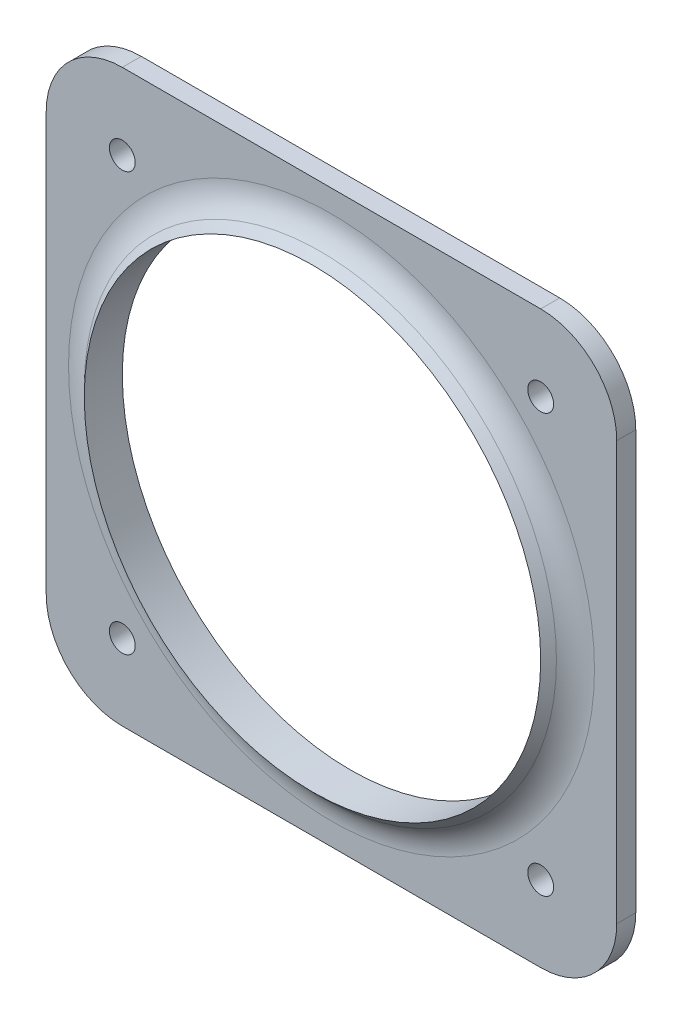
ISO-10303-21;
HEADER;
FILE_DESCRIPTION(('STEP AP214'),'2;1');
FILE_NAME('part.step','',(''),(''),'','','');
FILE_SCHEMA(('AUTOMOTIVE_DESIGN { 1 0 10303 214 1 1 1 1 }'));
ENDSEC;
DATA;
#1=APPLICATION_CONTEXT('core data for automotive mechanical design processes');
#2=APPLICATION_PROTOCOL_DEFINITION('international standard','automotive_design',2000,#1);
#3=PRODUCT_CONTEXT('',#1,'mechanical');
#4=PRODUCT('Part','Part','',(#3));
#5=PRODUCT_RELATED_PRODUCT_CATEGORY('part','',(#4));
#6=PRODUCT_DEFINITION_FORMATION('','',#4);
#7=PRODUCT_DEFINITION_CONTEXT('part definition',#1,'design');
#8=PRODUCT_DEFINITION('design','',#6,#7);
#9=PRODUCT_DEFINITION_SHAPE('','',#8);
#10=(LENGTH_UNIT() NAMED_UNIT(*) SI_UNIT(.MILLI.,.METRE.));
#11=(NAMED_UNIT(*) PLANE_ANGLE_UNIT() SI_UNIT($,.RADIAN.));
#12=(NAMED_UNIT(*) SI_UNIT($,.STERADIAN.) SOLID_ANGLE_UNIT());
#13=UNCERTAINTY_MEASURE_WITH_UNIT(LENGTH_MEASURE(1.E-05),#10,'distance_accuracy_value','');
#14=(GEOMETRIC_REPRESENTATION_CONTEXT(3) GLOBAL_UNCERTAINTY_ASSIGNED_CONTEXT((#13)) GLOBAL_UNIT_ASSIGNED_CONTEXT((#10,
#11,#12)) REPRESENTATION_CONTEXT('',''));
#15=CARTESIAN_POINT('',(0.,0.,0.));
#16=DIRECTION('',(0.,0.,1.));
#17=DIRECTION('',(1.,0.,0.));
#18=AXIS2_PLACEMENT_3D('',#15,#16,#17);
#19=CARTESIAN_POINT('',(0.,0.,3.175));
#20=DIRECTION('',(0.,0.,1.));
#21=DIRECTION('',(1.,0.,0.));
#22=AXIS2_PLACEMENT_3D('',#19,#20,#21);
#23=PLANE('',#22);
#24=CARTESIAN_POINT('',(-34.925,-34.925,3.175));
#25=DIRECTION('',(0.,0.,1.));
#26=DIRECTION('',(1.,0.,0.));
#27=AXIS2_PLACEMENT_3D('',#24,#25,#26);
#28=CIRCLE('',#27,2.159);
#29=CARTESIAN_POINT('',(-32.766,-34.925,3.175));
#30=VERTEX_POINT('',#29);
#31=EDGE_CURVE('E207',#30,#30,#28,.T.);
#32=ORIENTED_EDGE('',*,*,#31,.F.);
#33=EDGE_LOOP('',(#32));
#34=FACE_BOUND('',#33,.T.);
#35=CARTESIAN_POINT('',(34.925,-34.925,3.175));
#36=DIRECTION('',(0.,0.,1.));
#37=DIRECTION('',(1.,0.,0.));
#38=AXIS2_PLACEMENT_3D('',#35,#36,#37);
#39=CIRCLE('',#38,2.159);
#40=CARTESIAN_POINT('',(37.084,-34.925,3.175));
#41=VERTEX_POINT('',#40);
#42=EDGE_CURVE('E201',#41,#41,#39,.T.);
#43=ORIENTED_EDGE('',*,*,#42,.F.);
#44=EDGE_LOOP('',(#43));
#45=FACE_BOUND('',#44,.T.);
#46=CARTESIAN_POINT('',(34.925,34.925,3.175));
#47=DIRECTION('',(0.,0.,1.));
#48=DIRECTION('',(1.,0.,0.));
#49=AXIS2_PLACEMENT_3D('',#46,#47,#48);
#50=CIRCLE('',#49,2.159);
#51=CARTESIAN_POINT('',(37.084,34.925,3.175));
#52=VERTEX_POINT('',#51);
#53=EDGE_CURVE('E195',#52,#52,#50,.T.);
#54=ORIENTED_EDGE('',*,*,#53,.F.);
#55=EDGE_LOOP('',(#54));
#56=FACE_BOUND('',#55,.T.);
#57=CARTESIAN_POINT('',(-34.925,34.925,3.175));
#58=DIRECTION('',(0.,0.,1.));
#59=DIRECTION('',(1.,0.,0.));
#60=AXIS2_PLACEMENT_3D('',#57,#58,#59);
#61=CIRCLE('',#60,2.159);
#62=CARTESIAN_POINT('',(-32.766,34.925,3.175));
#63=VERTEX_POINT('',#62);
#64=EDGE_CURVE('E189',#63,#63,#61,.T.);
#65=ORIENTED_EDGE('',*,*,#64,.F.);
#66=EDGE_LOOP('',(#65));
#67=FACE_BOUND('',#66,.T.);
#68=CARTESIAN_POINT('',(1.95734232339416E-13,0.,3.175));
#69=DIRECTION('',(0.,0.,1.));
#70=DIRECTION('',(1.,0.,0.));
#71=AXIS2_PLACEMENT_3D('',#68,#69,#70);
#72=CIRCLE('',#71,43.9052561210692);
#73=CARTESIAN_POINT('',(43.9052561210694,0.,3.175));
#74=VERTEX_POINT('',#73);
#75=EDGE_CURVE('E145',#74,#74,#72,.F.);
#76=ORIENTED_EDGE('',*,*,#75,.T.);
#77=EDGE_LOOP('',(#76));
#78=FACE_BOUND('',#77,.T.);
#79=DIRECTION('',(-1.,0.,0.));
#80=VECTOR('',#79,1.);
#81=CARTESIAN_POINT('',(47.625,47.625,3.175));
#82=LINE('',#81,#80);
#83=CARTESIAN_POINT('',(34.925,47.625,3.175));
#84=VERTEX_POINT('',#83);
#85=CARTESIAN_POINT('',(-34.925,47.625,3.175));
#86=VERTEX_POINT('',#85);
#87=EDGE_CURVE('E136',#84,#86,#82,.T.);
#88=ORIENTED_EDGE('',*,*,#87,.T.);
#89=CARTESIAN_POINT('',(-34.925,34.925,3.175));
#90=DIRECTION('',(0.,0.,1.));
#91=DIRECTION('',(1.,0.,0.));
#92=AXIS2_PLACEMENT_3D('',#89,#90,#91);
#93=CIRCLE('',#92,12.7);
#94=CARTESIAN_POINT('',(-47.625,34.925,3.175));
#95=VERTEX_POINT('',#94);
#96=EDGE_CURVE('E161',#86,#95,#93,.T.);
#97=ORIENTED_EDGE('',*,*,#96,.T.);
#98=DIRECTION('',(0.,-1.,0.));
#99=VECTOR('',#98,1.);
#100=CARTESIAN_POINT('',(-47.625,-47.625,3.175));
#101=LINE('',#100,#99);
#102=CARTESIAN_POINT('',(-47.625,-34.925,3.175));
#103=VERTEX_POINT('',#102);
#104=EDGE_CURVE('E119',#95,#103,#101,.T.);
#105=ORIENTED_EDGE('',*,*,#104,.T.);
#106=CARTESIAN_POINT('',(-34.925,-34.925,3.175));
#107=DIRECTION('',(0.,0.,1.));
#108=DIRECTION('',(1.,0.,0.));
#109=AXIS2_PLACEMENT_3D('',#106,#107,#108);
#110=CIRCLE('',#109,12.7);
#111=CARTESIAN_POINT('',(-34.925,-47.625,3.175));
#112=VERTEX_POINT('',#111);
#113=EDGE_CURVE('E156',#103,#112,#110,.T.);
#114=ORIENTED_EDGE('',*,*,#113,.T.);
#115=DIRECTION('',(1.,0.,0.));
#116=VECTOR('',#115,1.);
#117=CARTESIAN_POINT('',(47.625,-47.625,3.175));
#118=LINE('',#117,#116);
#119=CARTESIAN_POINT('',(34.925,-47.625,3.175));
#120=VERTEX_POINT('',#119);
#121=EDGE_CURVE('E172',#112,#120,#118,.T.);
#122=ORIENTED_EDGE('',*,*,#121,.T.);
#123=CARTESIAN_POINT('',(34.925,-34.925,3.175));
#124=DIRECTION('',(0.,0.,1.));
#125=DIRECTION('',(1.,0.,0.));
#126=AXIS2_PLACEMENT_3D('',#123,#124,#125);
#127=CIRCLE('',#126,12.7);
#128=CARTESIAN_POINT('',(47.625,-34.925,3.175));
#129=VERTEX_POINT('',#128);
#130=EDGE_CURVE('E55',#120,#129,#127,.T.);
#131=ORIENTED_EDGE('',*,*,#130,.T.);
#132=DIRECTION('',(0.,1.,0.));
#133=VECTOR('',#132,1.);
#134=CARTESIAN_POINT('',(47.625,-47.625,3.175));
#135=LINE('',#134,#133);
#136=CARTESIAN_POINT('',(47.625,34.925,3.175));
#137=VERTEX_POINT('',#136);
#138=EDGE_CURVE('E180',#129,#137,#135,.T.);
#139=ORIENTED_EDGE('',*,*,#138,.T.);
#140=CARTESIAN_POINT('',(34.925,34.925,3.175));
#141=DIRECTION('',(0.,0.,1.));
#142=DIRECTION('',(1.,0.,0.));
#143=AXIS2_PLACEMENT_3D('',#140,#141,#142);
#144=CIRCLE('',#143,12.7);
#145=EDGE_CURVE('E159',#137,#84,#144,.T.);
#146=ORIENTED_EDGE('',*,*,#145,.T.);
#147=EDGE_LOOP('',(#88,#97,#105,#114,#122,#131,#139,#146));
#148=FACE_BOUND('',#147,.T.);
#149=ADVANCED_FACE('F33',(#34,#45,#56,#67,#78,#148),#23,.T.);
#150=CARTESIAN_POINT('',(0.,0.,0.));
#151=DIRECTION('',(0.,0.,1.));
#152=DIRECTION('',(1.,0.,0.));
#153=AXIS2_PLACEMENT_3D('',#150,#151,#152);
#154=PLANE('',#153);
#155=CARTESIAN_POINT('',(-34.925,-34.925,0.));
#156=DIRECTION('',(0.,0.,1.));
#157=DIRECTION('',(1.,0.,0.));
#158=AXIS2_PLACEMENT_3D('',#155,#156,#157);
#159=CIRCLE('',#158,2.159);
#160=CARTESIAN_POINT('',(-32.766,-34.925,0.));
#161=VERTEX_POINT('',#160);
#162=EDGE_CURVE('E204',#161,#161,#159,.T.);
#163=ORIENTED_EDGE('',*,*,#162,.T.);
#164=EDGE_LOOP('',(#163));
#165=FACE_BOUND('',#164,.T.);
#166=CARTESIAN_POINT('',(34.925,-34.925,0.));
#167=DIRECTION('',(0.,0.,1.));
#168=DIRECTION('',(1.,0.,0.));
#169=AXIS2_PLACEMENT_3D('',#166,#167,#168);
#170=CIRCLE('',#169,2.159);
#171=CARTESIAN_POINT('',(37.084,-34.925,0.));
#172=VERTEX_POINT('',#171);
#173=EDGE_CURVE('E198',#172,#172,#170,.T.);
#174=ORIENTED_EDGE('',*,*,#173,.T.);
#175=EDGE_LOOP('',(#174));
#176=FACE_BOUND('',#175,.T.);
#177=CARTESIAN_POINT('',(34.925,34.925,0.));
#178=DIRECTION('',(0.,0.,1.));
#179=DIRECTION('',(1.,0.,0.));
#180=AXIS2_PLACEMENT_3D('',#177,#178,#179);
#181=CIRCLE('',#180,2.159);
#182=CARTESIAN_POINT('',(37.084,34.925,0.));
#183=VERTEX_POINT('',#182);
#184=EDGE_CURVE('E192',#183,#183,#181,.T.);
#185=ORIENTED_EDGE('',*,*,#184,.T.);
#186=EDGE_LOOP('',(#185));
#187=FACE_BOUND('',#186,.T.);
#188=CARTESIAN_POINT('',(-34.925,34.925,0.));
#189=DIRECTION('',(0.,0.,1.));
#190=DIRECTION('',(1.,0.,0.));
#191=AXIS2_PLACEMENT_3D('',#188,#189,#190);
#192=CIRCLE('',#191,2.159);
#193=CARTESIAN_POINT('',(-32.766,34.925,0.));
#194=VERTEX_POINT('',#193);
#195=EDGE_CURVE('E188',#194,#194,#192,.T.);
#196=ORIENTED_EDGE('',*,*,#195,.T.);
#197=EDGE_LOOP('',(#196));
#198=FACE_BOUND('',#197,.T.);
#199=DIRECTION('',(0.,-1.,0.));
#200=VECTOR('',#199,1.);
#201=CARTESIAN_POINT('',(-47.625,-47.625,0.));
#202=LINE('',#201,#200);
#203=CARTESIAN_POINT('',(-47.625,34.925,0.));
#204=VERTEX_POINT('',#203);
#205=CARTESIAN_POINT('',(-47.625,-34.925,0.));
#206=VERTEX_POINT('',#205);
#207=EDGE_CURVE('E116',#204,#206,#202,.T.);
#208=ORIENTED_EDGE('',*,*,#207,.F.);
#209=CARTESIAN_POINT('',(-34.925,34.925,0.));
#210=DIRECTION('',(0.,0.,1.));
#211=DIRECTION('',(1.,0.,0.));
#212=AXIS2_PLACEMENT_3D('',#209,#210,#211);
#213=CIRCLE('',#212,12.7);
#214=CARTESIAN_POINT('',(-34.925,47.625,0.));
#215=VERTEX_POINT('',#214);
#216=EDGE_CURVE('E99',#204,#215,#213,.F.);
#217=ORIENTED_EDGE('',*,*,#216,.T.);
#218=DIRECTION('',(-1.,0.,0.));
#219=VECTOR('',#218,1.);
#220=CARTESIAN_POINT('',(47.625,47.625,0.));
#221=LINE('',#220,#219);
#222=CARTESIAN_POINT('',(34.925,47.625,0.));
#223=VERTEX_POINT('',#222);
#224=EDGE_CURVE('E140',#223,#215,#221,.T.);
#225=ORIENTED_EDGE('',*,*,#224,.F.);
#226=CARTESIAN_POINT('',(34.925,34.925,0.));
#227=DIRECTION('',(0.,0.,1.));
#228=DIRECTION('',(1.,0.,0.));
#229=AXIS2_PLACEMENT_3D('',#226,#227,#228);
#230=CIRCLE('',#229,12.7);
#231=CARTESIAN_POINT('',(47.625,34.925,0.));
#232=VERTEX_POINT('',#231);
#233=EDGE_CURVE('E110',#223,#232,#230,.F.);
#234=ORIENTED_EDGE('',*,*,#233,.T.);
#235=DIRECTION('',(0.,1.,0.));
#236=VECTOR('',#235,1.);
#237=CARTESIAN_POINT('',(47.625,-47.625,0.));
#238=LINE('',#237,#236);
#239=CARTESIAN_POINT('',(47.625,-34.925,0.));
#240=VERTEX_POINT('',#239);
#241=EDGE_CURVE('E130',#240,#232,#238,.T.);
#242=ORIENTED_EDGE('',*,*,#241,.F.);
#243=CARTESIAN_POINT('',(34.925,-34.925,0.));
#244=DIRECTION('',(0.,0.,1.));
#245=DIRECTION('',(1.,0.,0.));
#246=AXIS2_PLACEMENT_3D('',#243,#244,#245);
#247=CIRCLE('',#246,12.7);
#248=CARTESIAN_POINT('',(34.925,-47.625,0.));
#249=VERTEX_POINT('',#248);
#250=EDGE_CURVE('E150',#240,#249,#247,.F.);
#251=ORIENTED_EDGE('',*,*,#250,.T.);
#252=DIRECTION('',(1.,0.,0.));
#253=VECTOR('',#252,1.);
#254=CARTESIAN_POINT('',(47.625,-47.625,0.));
#255=LINE('',#254,#253);
#256=CARTESIAN_POINT('',(-34.925,-47.625,0.));
#257=VERTEX_POINT('',#256);
#258=EDGE_CURVE('E126',#257,#249,#255,.T.);
#259=ORIENTED_EDGE('',*,*,#258,.F.);
#260=CARTESIAN_POINT('',(-34.925,-34.925,0.));
#261=DIRECTION('',(0.,0.,1.));
#262=DIRECTION('',(1.,0.,0.));
#263=AXIS2_PLACEMENT_3D('',#260,#261,#262);
#264=CIRCLE('',#263,12.7);
#265=EDGE_CURVE('E120',#257,#206,#264,.F.);
#266=ORIENTED_EDGE('',*,*,#265,.T.);
#267=EDGE_LOOP('',(#208,#217,#225,#234,#242,#251,#259,#266));
#268=FACE_BOUND('',#267,.T.);
#269=CARTESIAN_POINT('',(0.,0.,0.));
#270=DIRECTION('',(0.,0.,1.));
#271=DIRECTION('',(1.,0.,0.));
#272=AXIS2_PLACEMENT_3D('',#269,#270,#271);
#273=CIRCLE('',#272,38.1);
#274=CARTESIAN_POINT('',(38.1,0.,0.));
#275=VERTEX_POINT('',#274);
#276=EDGE_CURVE('E127',#275,#275,#273,.T.);
#277=ORIENTED_EDGE('',*,*,#276,.T.);
#278=EDGE_LOOP('',(#277));
#279=FACE_BOUND('',#278,.T.);
#280=ADVANCED_FACE('F123',(#165,#176,#187,#198,#268,#279),#154,.F.);
#281=CARTESIAN_POINT('',(-47.625,-47.625,3.175));
#282=DIRECTION('',(1.,0.,0.));
#283=DIRECTION('',(0.,0.,-1.));
#284=AXIS2_PLACEMENT_3D('',#281,#282,#283);
#285=PLANE('',#284);
#286=ORIENTED_EDGE('',*,*,#104,.F.);
#287=DIRECTION('',(0.,0.,-1.));
#288=VECTOR('',#287,1.);
#289=CARTESIAN_POINT('',(-47.625,34.925,3.175));
#290=LINE('',#289,#288);
#291=EDGE_CURVE('E103',#95,#204,#290,.T.);
#292=ORIENTED_EDGE('',*,*,#291,.T.);
#293=ORIENTED_EDGE('',*,*,#207,.T.);
#294=DIRECTION('',(0.,0.,-1.));
#295=VECTOR('',#294,1.);
#296=CARTESIAN_POINT('',(-47.625,-34.925,3.175));
#297=LINE('',#296,#295);
#298=EDGE_CURVE('E121',#206,#103,#297,.F.);
#299=ORIENTED_EDGE('',*,*,#298,.T.);
#300=EDGE_LOOP('',(#286,#292,#293,#299));
#301=FACE_BOUND('',#300,.T.);
#302=ADVANCED_FACE('F115',(#301),#285,.F.);
#303=CARTESIAN_POINT('',(47.625,-47.625,3.175));
#304=DIRECTION('',(0.,1.,0.));
#305=DIRECTION('',(-1.,0.,0.));
#306=AXIS2_PLACEMENT_3D('',#303,#304,#305);
#307=PLANE('',#306);
#308=ORIENTED_EDGE('',*,*,#258,.T.);
#309=DIRECTION('',(0.,0.,-1.));
#310=VECTOR('',#309,1.);
#311=CARTESIAN_POINT('',(34.925,-47.625,3.175));
#312=LINE('',#311,#310);
#313=EDGE_CURVE('E11',#249,#120,#312,.F.);
#314=ORIENTED_EDGE('',*,*,#313,.T.);
#315=ORIENTED_EDGE('',*,*,#121,.F.);
#316=DIRECTION('',(0.,0.,-1.));
#317=VECTOR('',#316,1.);
#318=CARTESIAN_POINT('',(-34.925,-47.625,3.175));
#319=LINE('',#318,#317);
#320=EDGE_CURVE('E41',#112,#257,#319,.T.);
#321=ORIENTED_EDGE('',*,*,#320,.T.);
#322=EDGE_LOOP('',(#308,#314,#315,#321));
#323=FACE_BOUND('',#322,.T.);
#324=ADVANCED_FACE('F170',(#323),#307,.F.);
#325=CARTESIAN_POINT('',(47.625,-47.625,3.175));
#326=DIRECTION('',(-1.,0.,0.));
#327=DIRECTION('',(0.,0.,1.));
#328=AXIS2_PLACEMENT_3D('',#325,#326,#327);
#329=PLANE('',#328);
#330=ORIENTED_EDGE('',*,*,#241,.T.);
#331=DIRECTION('',(0.,0.,-1.));
#332=VECTOR('',#331,1.);
#333=CARTESIAN_POINT('',(47.625,34.925,3.175));
#334=LINE('',#333,#332);
#335=EDGE_CURVE('E48',#232,#137,#334,.F.);
#336=ORIENTED_EDGE('',*,*,#335,.T.);
#337=ORIENTED_EDGE('',*,*,#138,.F.);
#338=DIRECTION('',(0.,0.,-1.));
#339=VECTOR('',#338,1.);
#340=CARTESIAN_POINT('',(47.625,-34.925,3.175));
#341=LINE('',#340,#339);
#342=EDGE_CURVE('E163',#129,#240,#341,.T.);
#343=ORIENTED_EDGE('',*,*,#342,.T.);
#344=EDGE_LOOP('',(#330,#336,#337,#343));
#345=FACE_BOUND('',#344,.T.);
#346=ADVANCED_FACE('F179',(#345),#329,.F.);
#347=CARTESIAN_POINT('',(47.625,47.625,3.175));
#348=DIRECTION('',(0.,-1.,0.));
#349=DIRECTION('',(1.,0.,0.));
#350=AXIS2_PLACEMENT_3D('',#347,#348,#349);
#351=PLANE('',#350);
#352=ORIENTED_EDGE('',*,*,#224,.T.);
#353=DIRECTION('',(0.,0.,-1.));
#354=VECTOR('',#353,1.);
#355=CARTESIAN_POINT('',(-34.925,47.625,3.175));
#356=LINE('',#355,#354);
#357=EDGE_CURVE('E104',#215,#86,#356,.F.);
#358=ORIENTED_EDGE('',*,*,#357,.T.);
#359=ORIENTED_EDGE('',*,*,#87,.F.);
#360=DIRECTION('',(0.,0.,-1.));
#361=VECTOR('',#360,1.);
#362=CARTESIAN_POINT('',(34.925,47.625,3.175));
#363=LINE('',#362,#361);
#364=EDGE_CURVE('E109',#84,#223,#363,.T.);
#365=ORIENTED_EDGE('',*,*,#364,.T.);
#366=EDGE_LOOP('',(#352,#358,#359,#365));
#367=FACE_BOUND('',#366,.T.);
#368=ADVANCED_FACE('F235',(#367),#351,.F.);
#369=CARTESIAN_POINT('',(0.,0.,3.175));
#370=DIRECTION('',(0.,0.,-1.));
#371=DIRECTION('',(-1.,0.,0.));
#372=AXIS2_PLACEMENT_3D('',#369,#370,#371);
#373=CYLINDRICAL_SURFACE('',#372,38.1);
#374=ORIENTED_EDGE('',*,*,#276,.F.);
#375=EDGE_LOOP('',(#374));
#376=FACE_BOUND('',#375,.T.);
#377=CARTESIAN_POINT('',(0.,0.,6.35000000000008));
#378=DIRECTION('',(0.,0.,1.));
#379=DIRECTION('',(1.,0.,0.));
#380=AXIS2_PLACEMENT_3D('',#377,#378,#379);
#381=CIRCLE('',#380,38.1);
#382=CARTESIAN_POINT('',(38.1,0.,6.34999999999995));
#383=VERTEX_POINT('',#382);
#384=EDGE_CURVE('E133',#383,#383,#381,.T.);
#385=ORIENTED_EDGE('',*,*,#384,.T.);
#386=EDGE_LOOP('',(#385));
#387=FACE_BOUND('',#386,.T.);
#388=ADVANCED_FACE('F260',(#376,#387),#373,.F.);
#389=CARTESIAN_POINT('',(0.,0.,6.35000000000008));
#390=DIRECTION('',(0.,0.,-1.));
#391=DIRECTION('',(-1.,0.,0.));
#392=AXIS2_PLACEMENT_3D('',#389,#390,#391);
#393=CONICAL_SURFACE('',#392,38.1,0.785398163397455);
#394=CARTESIAN_POINT('',(1.95734232339416E-13,0.,5.03487193946541));
#395=DIRECTION('',(0.,0.,-1.));
#396=DIRECTION('',(-1.,0.,0.));
#397=AXIS2_PLACEMENT_3D('',#394,#395,#396);
#398=CIRCLE('',#397,39.4151280605347);
#399=CARTESIAN_POINT('',(-39.4151280605345,0.,5.03487193946555));
#400=VERTEX_POINT('',#399);
#401=EDGE_CURVE('E142',#400,#400,#398,.F.);
#402=ORIENTED_EDGE('',*,*,#401,.T.);
#403=EDGE_LOOP('',(#402));
#404=FACE_BOUND('',#403,.T.);
#405=ORIENTED_EDGE('',*,*,#384,.F.);
#406=EDGE_LOOP('',(#405));
#407=FACE_BOUND('',#406,.T.);
#408=ADVANCED_FACE('F250',(#404,#407),#393,.T.);
#409=CARTESIAN_POINT('',(1.95734232339416E-13,0.,9.525));
#410=DIRECTION('',(0.,0.,1.));
#411=DIRECTION('',(1.,0.,0.));
#412=AXIS2_PLACEMENT_3D('',#409,#410,#411);
#413=TOROIDAL_SURFACE('',#412,43.9052561210692,6.35);
#414=ORIENTED_EDGE('',*,*,#75,.F.);
#415=EDGE_LOOP('',(#414));
#416=FACE_BOUND('',#415,.T.);
#417=ORIENTED_EDGE('',*,*,#401,.F.);
#418=EDGE_LOOP('',(#417));
#419=FACE_BOUND('',#418,.T.);
#420=ADVANCED_FACE('F246',(#416,#419),#413,.F.);
#421=CARTESIAN_POINT('',(-34.925,34.925,0.));
#422=DIRECTION('',(0.,0.,1.));
#423=DIRECTION('',(1.,0.,0.));
#424=AXIS2_PLACEMENT_3D('',#421,#422,#423);
#425=CYLINDRICAL_SURFACE('',#424,2.159);
#426=ORIENTED_EDGE('',*,*,#195,.F.);
#427=EDGE_LOOP('',(#426));
#428=FACE_BOUND('',#427,.T.);
#429=ORIENTED_EDGE('',*,*,#64,.T.);
#430=EDGE_LOOP('',(#429));
#431=FACE_BOUND('',#430,.T.);
#432=ADVANCED_FACE('F249',(#428,#431),#425,.F.);
#433=CARTESIAN_POINT('',(34.925,34.925,0.));
#434=DIRECTION('',(0.,0.,1.));
#435=DIRECTION('',(1.,0.,0.));
#436=AXIS2_PLACEMENT_3D('',#433,#434,#435);
#437=CYLINDRICAL_SURFACE('',#436,2.159);
#438=ORIENTED_EDGE('',*,*,#184,.F.);
#439=EDGE_LOOP('',(#438));
#440=FACE_BOUND('',#439,.T.);
#441=ORIENTED_EDGE('',*,*,#53,.T.);
#442=EDGE_LOOP('',(#441));
#443=FACE_BOUND('',#442,.T.);
#444=ADVANCED_FACE('F271',(#440,#443),#437,.F.);
#445=CARTESIAN_POINT('',(34.925,-34.925,0.));
#446=DIRECTION('',(0.,0.,1.));
#447=DIRECTION('',(1.,0.,0.));
#448=AXIS2_PLACEMENT_3D('',#445,#446,#447);
#449=CYLINDRICAL_SURFACE('',#448,2.159);
#450=ORIENTED_EDGE('',*,*,#173,.F.);
#451=EDGE_LOOP('',(#450));
#452=FACE_BOUND('',#451,.T.);
#453=ORIENTED_EDGE('',*,*,#42,.T.);
#454=EDGE_LOOP('',(#453));
#455=FACE_BOUND('',#454,.T.);
#456=ADVANCED_FACE('F218',(#452,#455),#449,.F.);
#457=CARTESIAN_POINT('',(-34.925,-34.925,0.));
#458=DIRECTION('',(0.,0.,1.));
#459=DIRECTION('',(1.,0.,0.));
#460=AXIS2_PLACEMENT_3D('',#457,#458,#459);
#461=CYLINDRICAL_SURFACE('',#460,2.159);
#462=ORIENTED_EDGE('',*,*,#162,.F.);
#463=EDGE_LOOP('',(#462));
#464=FACE_BOUND('',#463,.T.);
#465=ORIENTED_EDGE('',*,*,#31,.T.);
#466=EDGE_LOOP('',(#465));
#467=FACE_BOUND('',#466,.T.);
#468=ADVANCED_FACE('F215',(#464,#467),#461,.F.);
#469=CARTESIAN_POINT('',(-34.925,34.925,3.175));
#470=DIRECTION('',(0.,0.,-1.));
#471=DIRECTION('',(-1.,0.,0.));
#472=AXIS2_PLACEMENT_3D('',#469,#470,#471);
#473=CYLINDRICAL_SURFACE('',#472,12.7);
#474=ORIENTED_EDGE('',*,*,#96,.F.);
#475=ORIENTED_EDGE('',*,*,#357,.F.);
#476=ORIENTED_EDGE('',*,*,#216,.F.);
#477=ORIENTED_EDGE('',*,*,#291,.F.);
#478=EDGE_LOOP('',(#474,#475,#476,#477));
#479=FACE_BOUND('',#478,.T.);
#480=ADVANCED_FACE('F102',(#479),#473,.T.);
#481=CARTESIAN_POINT('',(34.925,34.925,3.175));
#482=DIRECTION('',(0.,0.,-1.));
#483=DIRECTION('',(-1.,0.,0.));
#484=AXIS2_PLACEMENT_3D('',#481,#482,#483);
#485=CYLINDRICAL_SURFACE('',#484,12.7);
#486=ORIENTED_EDGE('',*,*,#145,.F.);
#487=ORIENTED_EDGE('',*,*,#335,.F.);
#488=ORIENTED_EDGE('',*,*,#233,.F.);
#489=ORIENTED_EDGE('',*,*,#364,.F.);
#490=EDGE_LOOP('',(#486,#487,#488,#489));
#491=FACE_BOUND('',#490,.T.);
#492=ADVANCED_FACE('F237',(#491),#485,.T.);
#493=CARTESIAN_POINT('',(34.925,-34.925,3.175));
#494=DIRECTION('',(0.,0.,-1.));
#495=DIRECTION('',(-1.,0.,0.));
#496=AXIS2_PLACEMENT_3D('',#493,#494,#495);
#497=CYLINDRICAL_SURFACE('',#496,12.7);
#498=ORIENTED_EDGE('',*,*,#130,.F.);
#499=ORIENTED_EDGE('',*,*,#313,.F.);
#500=ORIENTED_EDGE('',*,*,#250,.F.);
#501=ORIENTED_EDGE('',*,*,#342,.F.);
#502=EDGE_LOOP('',(#498,#499,#500,#501));
#503=FACE_BOUND('',#502,.T.);
#504=ADVANCED_FACE('F178',(#503),#497,.T.);
#505=CARTESIAN_POINT('',(-34.925,-34.925,3.175));
#506=DIRECTION('',(0.,0.,-1.));
#507=DIRECTION('',(-1.,0.,0.));
#508=AXIS2_PLACEMENT_3D('',#505,#506,#507);
#509=CYLINDRICAL_SURFACE('',#508,12.7);
#510=ORIENTED_EDGE('',*,*,#113,.F.);
#511=ORIENTED_EDGE('',*,*,#298,.F.);
#512=ORIENTED_EDGE('',*,*,#265,.F.);
#513=ORIENTED_EDGE('',*,*,#320,.F.);
#514=EDGE_LOOP('',(#510,#511,#512,#513));
#515=FACE_BOUND('',#514,.T.);
#516=ADVANCED_FACE('F35',(#515),#509,.T.);
#517=CLOSED_SHELL('',(#149,#280,#302,#324,#346,#368,#388,#408,#420,#432,#444,#456,#468,#480,
#492,#504,#516));
#518=MANIFOLD_SOLID_BREP('B2',#517);
#519=ADVANCED_BREP_SHAPE_REPRESENTATION('',(#18,#518),#14);
#520=SHAPE_DEFINITION_REPRESENTATION(#9,#519);
ENDSEC;
END-ISO-10303-21;
